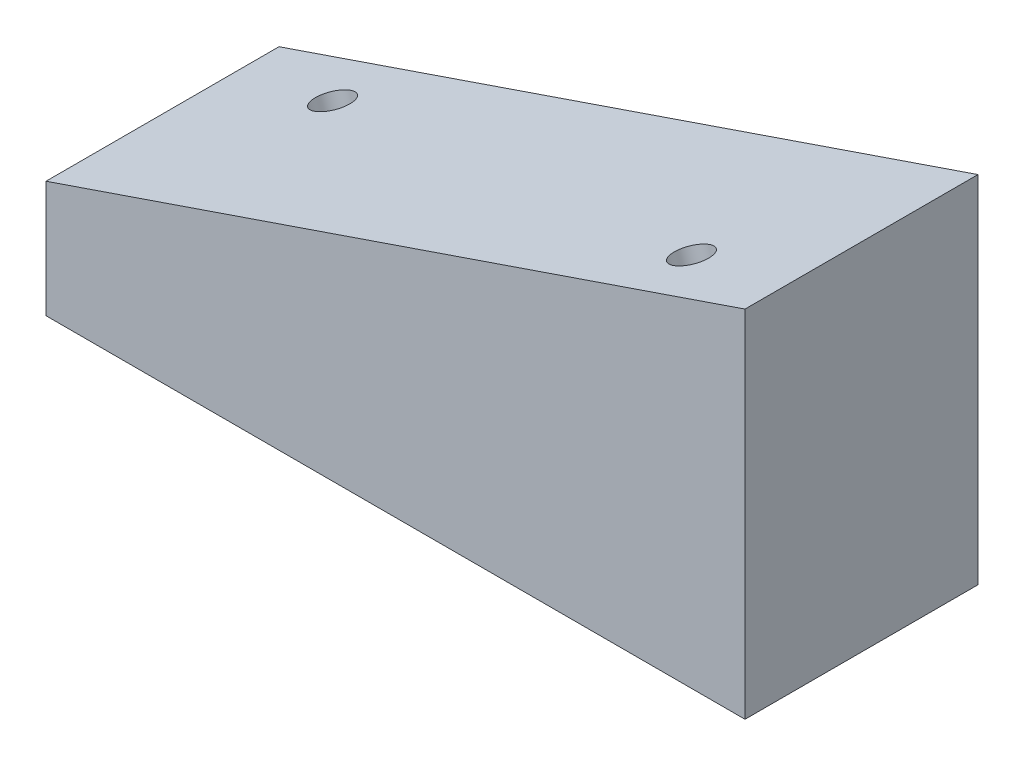
ISO-10303-21;
HEADER;
FILE_DESCRIPTION(('STEP AP214'),'2;1');
FILE_NAME('part.step','',(''),(''),'','','');
FILE_SCHEMA(('AUTOMOTIVE_DESIGN { 1 0 10303 214 1 1 1 1 }'));
ENDSEC;
DATA;
#1=APPLICATION_CONTEXT('core data for automotive mechanical design processes');
#2=APPLICATION_PROTOCOL_DEFINITION('international standard','automotive_design',2000,#1);
#3=PRODUCT_CONTEXT('',#1,'mechanical');
#4=PRODUCT('Part','Part','',(#3));
#5=PRODUCT_RELATED_PRODUCT_CATEGORY('part','',(#4));
#6=PRODUCT_DEFINITION_FORMATION('','',#4);
#7=PRODUCT_DEFINITION_CONTEXT('part definition',#1,'design');
#8=PRODUCT_DEFINITION('design','',#6,#7);
#9=PRODUCT_DEFINITION_SHAPE('','',#8);
#10=(LENGTH_UNIT() NAMED_UNIT(*) SI_UNIT(.MILLI.,.METRE.));
#11=(NAMED_UNIT(*) PLANE_ANGLE_UNIT() SI_UNIT($,.RADIAN.));
#12=(NAMED_UNIT(*) SI_UNIT($,.STERADIAN.) SOLID_ANGLE_UNIT());
#13=UNCERTAINTY_MEASURE_WITH_UNIT(LENGTH_MEASURE(1.E-05),#10,'distance_accuracy_value','');
#14=(GEOMETRIC_REPRESENTATION_CONTEXT(3) GLOBAL_UNCERTAINTY_ASSIGNED_CONTEXT((#13)) GLOBAL_UNIT_ASSIGNED_CONTEXT((#10,
#11,#12)) REPRESENTATION_CONTEXT('',''));
#15=CARTESIAN_POINT('',(0.,0.,0.));
#16=DIRECTION('',(0.,0.,1.));
#17=DIRECTION('',(1.,0.,0.));
#18=AXIS2_PLACEMENT_3D('',#15,#16,#17);
#19=CARTESIAN_POINT('',(-76.2,25.4,-50.8));
#20=DIRECTION('',(-1.,0.,0.));
#21=DIRECTION('',(0.,0.,1.));
#22=AXIS2_PLACEMENT_3D('',#19,#20,#21);
#23=PLANE('',#22);
#24=DIRECTION('',(0.,-1.,0.));
#25=VECTOR('',#24,1.);
#26=CARTESIAN_POINT('',(-76.2,25.4,0.));
#27=LINE('',#26,#25);
#28=CARTESIAN_POINT('',(-76.2,25.4,0.));
#29=VERTEX_POINT('',#28);
#30=CARTESIAN_POINT('',(-76.2,0.,0.));
#31=VERTEX_POINT('',#30);
#32=EDGE_CURVE('E127',#29,#31,#27,.T.);
#33=ORIENTED_EDGE('',*,*,#32,.F.);
#34=DIRECTION('',(0.,0.,1.));
#35=VECTOR('',#34,1.);
#36=CARTESIAN_POINT('',(-76.2,25.4,-50.8));
#37=LINE('',#36,#35);
#38=CARTESIAN_POINT('',(-76.2,25.4,-50.8));
#39=VERTEX_POINT('',#38);
#40=EDGE_CURVE('E11',#39,#29,#37,.T.);
#41=ORIENTED_EDGE('',*,*,#40,.F.);
#42=DIRECTION('',(0.,-1.,0.));
#43=VECTOR('',#42,1.);
#44=CARTESIAN_POINT('',(-76.2,25.4,-50.8));
#45=LINE('',#44,#43);
#46=CARTESIAN_POINT('',(-76.2,0.,-50.8));
#47=VERTEX_POINT('',#46);
#48=EDGE_CURVE('E128',#39,#47,#45,.T.);
#49=ORIENTED_EDGE('',*,*,#48,.T.);
#50=DIRECTION('',(0.,0.,1.));
#51=VECTOR('',#50,1.);
#52=CARTESIAN_POINT('',(-76.2,0.,-50.8));
#53=LINE('',#52,#51);
#54=EDGE_CURVE('E39',#47,#31,#53,.T.);
#55=ORIENTED_EDGE('',*,*,#54,.T.);
#56=EDGE_LOOP('',(#33,#41,#49,#55));
#57=FACE_BOUND('',#56,.T.);
#58=ADVANCED_FACE('F36',(#57),#23,.T.);
#59=CARTESIAN_POINT('',(76.2,77.4593438028308,-50.8));
#60=DIRECTION('',(-0.323256847134431,0.946311265272007,0.));
#61=DIRECTION('',(-0.946311265272007,-0.323256847134431,0.));
#62=AXIS2_PLACEMENT_3D('',#59,#60,#61);
#63=PLANE('',#62);
#64=CARTESIAN_POINT('',(-51.8282851098662,33.7252984549215,-38.1));
#65=DIRECTION('',(-0.323256847134431,0.946311265272007,0.));
#66=DIRECTION('',(-0.946311265272007,-0.323256847134431,0.));
#67=AXIS2_PLACEMENT_3D('',#64,#65,#66);
#68=CIRCLE('',#67,3.96874999999999);
#69=CARTESIAN_POINT('',(-55.5839579439145,32.4423728428568,-38.1));
#70=VERTEX_POINT('',#69);
#71=EDGE_CURVE('E115',#70,#70,#68,.T.);
#72=ORIENTED_EDGE('',*,*,#71,.F.);
#73=EDGE_LOOP('',(#72));
#74=FACE_BOUND('',#73,.T.);
#75=CARTESIAN_POINT('',(51.8282851098663,69.1340453479093,-12.7));
#76=DIRECTION('',(-0.323256847134431,0.946311265272007,0.));
#77=DIRECTION('',(-0.946311265272007,-0.323256847134431,0.));
#78=AXIS2_PLACEMENT_3D('',#75,#76,#77);
#79=CIRCLE('',#78,3.96874999999999);
#80=CARTESIAN_POINT('',(48.072612275818,67.8511197358445,-12.7));
#81=VERTEX_POINT('',#80);
#82=EDGE_CURVE('E121',#81,#81,#79,.T.);
#83=ORIENTED_EDGE('',*,*,#82,.F.);
#84=EDGE_LOOP('',(#83));
#85=FACE_BOUND('',#84,.T.);
#86=DIRECTION('',(-0.946311265272007,-0.323256847134431,0.));
#87=VECTOR('',#86,1.);
#88=CARTESIAN_POINT('',(76.2,77.4593438028308,0.));
#89=LINE('',#88,#87);
#90=CARTESIAN_POINT('',(76.2,77.4593438028308,0.));
#91=VERTEX_POINT('',#90);
#92=EDGE_CURVE('E131',#91,#29,#89,.T.);
#93=ORIENTED_EDGE('',*,*,#92,.F.);
#94=DIRECTION('',(0.,0.,1.));
#95=VECTOR('',#94,1.);
#96=CARTESIAN_POINT('',(76.2,77.4593438028308,-50.8));
#97=LINE('',#96,#95);
#98=CARTESIAN_POINT('',(76.2,77.4593438028308,-50.8));
#99=VERTEX_POINT('',#98);
#100=EDGE_CURVE('E45',#99,#91,#97,.T.);
#101=ORIENTED_EDGE('',*,*,#100,.F.);
#102=DIRECTION('',(-0.946311265272007,-0.323256847134431,0.));
#103=VECTOR('',#102,1.);
#104=CARTESIAN_POINT('',(76.2,77.4593438028308,-50.8));
#105=LINE('',#104,#103);
#106=EDGE_CURVE('E135',#99,#39,#105,.T.);
#107=ORIENTED_EDGE('',*,*,#106,.T.);
#108=ORIENTED_EDGE('',*,*,#40,.T.);
#109=EDGE_LOOP('',(#93,#101,#107,#108));
#110=FACE_BOUND('',#109,.T.);
#111=ADVANCED_FACE('F150',(#74,#85,#110),#63,.T.);
#112=CARTESIAN_POINT('',(76.2,0.,-50.8));
#113=DIRECTION('',(1.,0.,0.));
#114=DIRECTION('',(0.,0.,-1.));
#115=AXIS2_PLACEMENT_3D('',#112,#113,#114);
#116=PLANE('',#115);
#117=DIRECTION('',(0.,1.,0.));
#118=VECTOR('',#117,1.);
#119=CARTESIAN_POINT('',(76.2,0.,0.));
#120=LINE('',#119,#118);
#121=CARTESIAN_POINT('',(76.2,0.,0.));
#122=VERTEX_POINT('',#121);
#123=EDGE_CURVE('E142',#122,#91,#120,.T.);
#124=ORIENTED_EDGE('',*,*,#123,.F.);
#125=DIRECTION('',(0.,0.,1.));
#126=VECTOR('',#125,1.);
#127=CARTESIAN_POINT('',(76.2,0.,-50.8));
#128=LINE('',#127,#126);
#129=CARTESIAN_POINT('',(76.2,0.,-50.8));
#130=VERTEX_POINT('',#129);
#131=EDGE_CURVE('E146',#130,#122,#128,.T.);
#132=ORIENTED_EDGE('',*,*,#131,.F.);
#133=DIRECTION('',(0.,1.,0.));
#134=VECTOR('',#133,1.);
#135=CARTESIAN_POINT('',(76.2,0.,-50.8));
#136=LINE('',#135,#134);
#137=EDGE_CURVE('E133',#130,#99,#136,.T.);
#138=ORIENTED_EDGE('',*,*,#137,.T.);
#139=ORIENTED_EDGE('',*,*,#100,.T.);
#140=EDGE_LOOP('',(#124,#132,#138,#139));
#141=FACE_BOUND('',#140,.T.);
#142=ADVANCED_FACE('F153',(#141),#116,.T.);
#143=CARTESIAN_POINT('',(-76.2,0.,-50.8));
#144=DIRECTION('',(0.,-1.,0.));
#145=DIRECTION('',(1.,0.,0.));
#146=AXIS2_PLACEMENT_3D('',#143,#144,#145);
#147=PLANE('',#146);
#148=CARTESIAN_POINT('',(-38.1,0.,-25.4));
#149=DIRECTION('',(0.,-1.,0.));
#150=DIRECTION('',(0.,0.,-1.));
#151=AXIS2_PLACEMENT_3D('',#148,#149,#150);
#152=CIRCLE('',#151,3.96874999999999);
#153=CARTESIAN_POINT('',(-38.1,0.,-29.36875));
#154=VERTEX_POINT('',#153);
#155=EDGE_CURVE('E105',#154,#154,#152,.T.);
#156=ORIENTED_EDGE('',*,*,#155,.F.);
#157=EDGE_LOOP('',(#156));
#158=FACE_BOUND('',#157,.T.);
#159=CARTESIAN_POINT('',(38.1,0.,-25.4));
#160=DIRECTION('',(0.,-1.,0.));
#161=DIRECTION('',(0.,0.,-1.));
#162=AXIS2_PLACEMENT_3D('',#159,#160,#161);
#163=CIRCLE('',#162,3.96874999999999);
#164=CARTESIAN_POINT('',(38.1,0.,-29.36875));
#165=VERTEX_POINT('',#164);
#166=EDGE_CURVE('E104',#165,#165,#163,.T.);
#167=ORIENTED_EDGE('',*,*,#166,.F.);
#168=EDGE_LOOP('',(#167));
#169=FACE_BOUND('',#168,.T.);
#170=DIRECTION('',(1.,0.,0.));
#171=VECTOR('',#170,1.);
#172=CARTESIAN_POINT('',(-76.2,0.,0.));
#173=LINE('',#172,#171);
#174=EDGE_CURVE('E139',#31,#122,#173,.T.);
#175=ORIENTED_EDGE('',*,*,#174,.F.);
#176=ORIENTED_EDGE('',*,*,#54,.F.);
#177=DIRECTION('',(1.,0.,0.));
#178=VECTOR('',#177,1.);
#179=CARTESIAN_POINT('',(-76.2,0.,-50.8));
#180=LINE('',#179,#178);
#181=EDGE_CURVE('E130',#47,#130,#180,.T.);
#182=ORIENTED_EDGE('',*,*,#181,.T.);
#183=ORIENTED_EDGE('',*,*,#131,.T.);
#184=EDGE_LOOP('',(#175,#176,#182,#183));
#185=FACE_BOUND('',#184,.T.);
#186=ADVANCED_FACE('F147',(#158,#169,#185),#147,.T.);
#187=CARTESIAN_POINT('',(0.,0.,-50.8));
#188=DIRECTION('',(0.,0.,1.));
#189=DIRECTION('',(1.,0.,0.));
#190=AXIS2_PLACEMENT_3D('',#187,#188,#189);
#191=PLANE('',#190);
#192=ORIENTED_EDGE('',*,*,#48,.F.);
#193=ORIENTED_EDGE('',*,*,#106,.F.);
#194=ORIENTED_EDGE('',*,*,#137,.F.);
#195=ORIENTED_EDGE('',*,*,#181,.F.);
#196=EDGE_LOOP('',(#192,#193,#194,#195));
#197=FACE_BOUND('',#196,.T.);
#198=ADVANCED_FACE('F155',(#197),#191,.F.);
#199=CARTESIAN_POINT('',(0.,0.,0.));
#200=DIRECTION('',(0.,0.,1.));
#201=DIRECTION('',(1.,0.,0.));
#202=AXIS2_PLACEMENT_3D('',#199,#200,#201);
#203=PLANE('',#202);
#204=ORIENTED_EDGE('',*,*,#32,.T.);
#205=ORIENTED_EDGE('',*,*,#174,.T.);
#206=ORIENTED_EDGE('',*,*,#123,.T.);
#207=ORIENTED_EDGE('',*,*,#92,.T.);
#208=EDGE_LOOP('',(#204,#205,#206,#207));
#209=FACE_BOUND('',#208,.T.);
#210=ADVANCED_FACE('F149',(#209),#203,.T.);
#211=CARTESIAN_POINT('',(60.0390090270808,45.0977392100003,-12.7));
#212=DIRECTION('',(-0.323256847134431,0.946311265272007,0.));
#213=DIRECTION('',(-0.946311265272007,-0.323256847134431,0.));
#214=AXIS2_PLACEMENT_3D('',#211,#212,#213);
#215=CONICAL_SURFACE('',#214,3.96874999999999,1.02974425867665);
#216=CARTESIAN_POINT('',(60.8098685045124,42.841103306069,-12.7));
#217=VERTEX_POINT('',#216);
#218=VERTEX_LOOP('',#217);
#219=FACE_BOUND('',#218,.T.);
#220=CARTESIAN_POINT('',(60.0390090270808,45.0977392100003,-12.7));
#221=DIRECTION('',(-0.323256847134431,0.946311265272007,0.));
#222=DIRECTION('',(-0.946311265272007,-0.323256847134431,0.));
#223=AXIS2_PLACEMENT_3D('',#220,#221,#222);
#224=CIRCLE('',#223,3.96874999999999);
#225=CARTESIAN_POINT('',(56.2833361930325,43.8148135979355,-12.7));
#226=VERTEX_POINT('',#225);
#227=EDGE_CURVE('E124',#226,#226,#224,.T.);
#228=ORIENTED_EDGE('',*,*,#227,.T.);
#229=EDGE_LOOP('',(#228));
#230=FACE_BOUND('',#229,.T.);
#231=ADVANCED_FACE('F162',(#219,#230),#215,.F.);
#232=CARTESIAN_POINT('',(51.8282851098663,69.1340453479093,-12.7));
#233=DIRECTION('',(-0.323256847134431,0.946311265272007,0.));
#234=DIRECTION('',(-0.946311265272007,-0.323256847134431,0.));
#235=AXIS2_PLACEMENT_3D('',#232,#233,#234);
#236=CYLINDRICAL_SURFACE('',#235,3.96874999999999);
#237=ORIENTED_EDGE('',*,*,#227,.F.);
#238=EDGE_LOOP('',(#237));
#239=FACE_BOUND('',#238,.T.);
#240=ORIENTED_EDGE('',*,*,#82,.T.);
#241=EDGE_LOOP('',(#240));
#242=FACE_BOUND('',#241,.T.);
#243=ADVANCED_FACE('F180',(#239,#242),#236,.F.);
#244=CARTESIAN_POINT('',(-43.6175611926517,9.68899231701257,-38.1));
#245=DIRECTION('',(-0.323256847134431,0.946311265272007,0.));
#246=DIRECTION('',(-0.946311265272007,-0.323256847134431,0.));
#247=AXIS2_PLACEMENT_3D('',#244,#245,#246);
#248=CONICAL_SURFACE('',#247,3.96874999999999,1.02974425867665);
#249=CARTESIAN_POINT('',(-42.8467017152201,7.43235641308132,-38.1));
#250=VERTEX_POINT('',#249);
#251=VERTEX_LOOP('',#250);
#252=FACE_BOUND('',#251,.T.);
#253=CARTESIAN_POINT('',(-43.6175611926517,9.68899231701257,-38.1));
#254=DIRECTION('',(-0.323256847134431,0.946311265272007,0.));
#255=DIRECTION('',(-0.946311265272007,-0.323256847134431,0.));
#256=AXIS2_PLACEMENT_3D('',#253,#254,#255);
#257=CIRCLE('',#256,3.96874999999999);
#258=CARTESIAN_POINT('',(-47.3732340267,8.4060667049478,-38.1));
#259=VERTEX_POINT('',#258);
#260=EDGE_CURVE('E118',#259,#259,#257,.T.);
#261=ORIENTED_EDGE('',*,*,#260,.T.);
#262=EDGE_LOOP('',(#261));
#263=FACE_BOUND('',#262,.T.);
#264=ADVANCED_FACE('F182',(#252,#263),#248,.F.);
#265=CARTESIAN_POINT('',(-51.8282851098662,33.7252984549215,-38.1));
#266=DIRECTION('',(-0.323256847134431,0.946311265272007,0.));
#267=DIRECTION('',(-0.946311265272007,-0.323256847134431,0.));
#268=AXIS2_PLACEMENT_3D('',#265,#266,#267);
#269=CYLINDRICAL_SURFACE('',#268,3.96874999999999);
#270=ORIENTED_EDGE('',*,*,#260,.F.);
#271=EDGE_LOOP('',(#270));
#272=FACE_BOUND('',#271,.T.);
#273=ORIENTED_EDGE('',*,*,#71,.T.);
#274=EDGE_LOOP('',(#273));
#275=FACE_BOUND('',#274,.T.);
#276=ADVANCED_FACE('F189',(#272,#275),#269,.F.);
#277=CARTESIAN_POINT('',(38.1,25.4,-25.4));
#278=DIRECTION('',(0.,-1.,0.));
#279=DIRECTION('',(0.,0.,-1.));
#280=AXIS2_PLACEMENT_3D('',#277,#278,#279);
#281=CONICAL_SURFACE('',#280,3.96874999999999,1.02974425867665);
#282=CARTESIAN_POINT('',(38.1,27.7846655817656,-25.4));
#283=VERTEX_POINT('',#282);
#284=VERTEX_LOOP('',#283);
#285=FACE_BOUND('',#284,.T.);
#286=CARTESIAN_POINT('',(38.1,25.4,-25.4));
#287=DIRECTION('',(0.,-1.,0.));
#288=DIRECTION('',(0.,0.,-1.));
#289=AXIS2_PLACEMENT_3D('',#286,#287,#288);
#290=CIRCLE('',#289,3.96874999999999);
#291=CARTESIAN_POINT('',(38.1,25.4,-29.36875));
#292=VERTEX_POINT('',#291);
#293=EDGE_CURVE('E108',#292,#292,#290,.T.);
#294=ORIENTED_EDGE('',*,*,#293,.T.);
#295=EDGE_LOOP('',(#294));
#296=FACE_BOUND('',#295,.T.);
#297=ADVANCED_FACE('F197',(#285,#296),#281,.F.);
#298=CARTESIAN_POINT('',(38.1,0.,-25.4));
#299=DIRECTION('',(0.,-1.,0.));
#300=DIRECTION('',(0.,0.,-1.));
#301=AXIS2_PLACEMENT_3D('',#298,#299,#300);
#302=CYLINDRICAL_SURFACE('',#301,3.96874999999999);
#303=ORIENTED_EDGE('',*,*,#293,.F.);
#304=EDGE_LOOP('',(#303));
#305=FACE_BOUND('',#304,.T.);
#306=ORIENTED_EDGE('',*,*,#166,.T.);
#307=EDGE_LOOP('',(#306));
#308=FACE_BOUND('',#307,.T.);
#309=ADVANCED_FACE('F98',(#305,#308),#302,.F.);
#310=CARTESIAN_POINT('',(-38.1,25.4,-25.4));
#311=DIRECTION('',(0.,-1.,0.));
#312=DIRECTION('',(0.,0.,-1.));
#313=AXIS2_PLACEMENT_3D('',#310,#311,#312);
#314=CONICAL_SURFACE('',#313,3.96874999999999,1.02974425867665);
#315=CARTESIAN_POINT('',(-38.1,27.7846655817656,-25.4));
#316=VERTEX_POINT('',#315);
#317=VERTEX_LOOP('',#316);
#318=FACE_BOUND('',#317,.T.);
#319=CARTESIAN_POINT('',(-38.1,25.4,-25.4));
#320=DIRECTION('',(0.,-1.,0.));
#321=DIRECTION('',(0.,0.,-1.));
#322=AXIS2_PLACEMENT_3D('',#319,#320,#321);
#323=CIRCLE('',#322,3.96874999999999);
#324=CARTESIAN_POINT('',(-38.1,25.4,-29.36875));
#325=VERTEX_POINT('',#324);
#326=EDGE_CURVE('E102',#325,#325,#323,.T.);
#327=ORIENTED_EDGE('',*,*,#326,.T.);
#328=EDGE_LOOP('',(#327));
#329=FACE_BOUND('',#328,.T.);
#330=ADVANCED_FACE('F94',(#318,#329),#314,.F.);
#331=CARTESIAN_POINT('',(-38.1,0.,-25.4));
#332=DIRECTION('',(0.,-1.,0.));
#333=DIRECTION('',(0.,0.,-1.));
#334=AXIS2_PLACEMENT_3D('',#331,#332,#333);
#335=CYLINDRICAL_SURFACE('',#334,3.96874999999999);
#336=ORIENTED_EDGE('',*,*,#326,.F.);
#337=EDGE_LOOP('',(#336));
#338=FACE_BOUND('',#337,.T.);
#339=ORIENTED_EDGE('',*,*,#155,.T.);
#340=EDGE_LOOP('',(#339));
#341=FACE_BOUND('',#340,.T.);
#342=ADVANCED_FACE('F97',(#338,#341),#335,.F.);
#343=CLOSED_SHELL('',(#58,#111,#142,#186,#198,#210,#231,#243,#264,#276,#297,#309,#330,#342));
#344=MANIFOLD_SOLID_BREP('B2',#343);
#345=ADVANCED_BREP_SHAPE_REPRESENTATION('',(#18,#344),#14);
#346=SHAPE_DEFINITION_REPRESENTATION(#9,#345);
ENDSEC;
END-ISO-10303-21;
